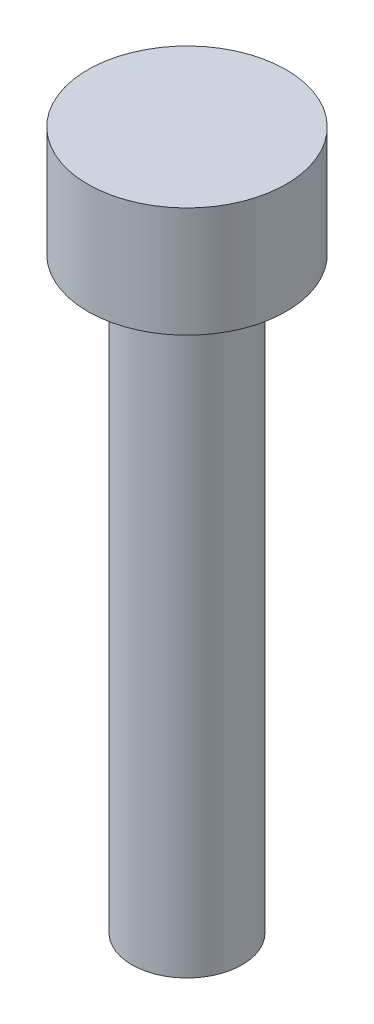
ISO-10303-21;
HEADER;
FILE_DESCRIPTION(('STEP AP214'),'2;1');
FILE_NAME('part.step','',(''),(''),'','','');
FILE_SCHEMA(('AUTOMOTIVE_DESIGN { 1 0 10303 214 1 1 1 1 }'));
ENDSEC;
DATA;
#1=APPLICATION_CONTEXT('core data for automotive mechanical design processes');
#2=APPLICATION_PROTOCOL_DEFINITION('international standard','automotive_design',2000,#1);
#3=PRODUCT_CONTEXT('',#1,'mechanical');
#4=PRODUCT('Part','Part','',(#3));
#5=PRODUCT_RELATED_PRODUCT_CATEGORY('part','',(#4));
#6=PRODUCT_DEFINITION_FORMATION('','',#4);
#7=PRODUCT_DEFINITION_CONTEXT('part definition',#1,'design');
#8=PRODUCT_DEFINITION('design','',#6,#7);
#9=PRODUCT_DEFINITION_SHAPE('','',#8);
#10=(LENGTH_UNIT() NAMED_UNIT(*) SI_UNIT(.MILLI.,.METRE.));
#11=(NAMED_UNIT(*) PLANE_ANGLE_UNIT() SI_UNIT($,.RADIAN.));
#12=(NAMED_UNIT(*) SI_UNIT($,.STERADIAN.) SOLID_ANGLE_UNIT());
#13=UNCERTAINTY_MEASURE_WITH_UNIT(LENGTH_MEASURE(1.E-05),#10,'distance_accuracy_value','');
#14=(GEOMETRIC_REPRESENTATION_CONTEXT(3) GLOBAL_UNCERTAINTY_ASSIGNED_CONTEXT((#13)) GLOBAL_UNIT_ASSIGNED_CONTEXT((#10,
#11,#12)) REPRESENTATION_CONTEXT('',''));
#15=CARTESIAN_POINT('',(0.,0.,0.));
#16=DIRECTION('',(0.,0.,1.));
#17=DIRECTION('',(1.,0.,0.));
#18=AXIS2_PLACEMENT_3D('',#15,#16,#17);
#19=CARTESIAN_POINT('',(0.,16.,0.));
#20=DIRECTION('',(0.,-1.,0.));
#21=DIRECTION('',(0.,0.,-1.));
#22=AXIS2_PLACEMENT_3D('',#19,#20,#21);
#23=CYLINDRICAL_SURFACE('',#22,1.5);
#24=CARTESIAN_POINT('',(0.,16.,0.));
#25=DIRECTION('',(0.,1.,0.));
#26=DIRECTION('',(0.,0.,1.));
#27=AXIS2_PLACEMENT_3D('',#24,#25,#26);
#28=CIRCLE('',#27,1.5);
#29=CARTESIAN_POINT('',(0.,16.,1.5));
#30=VERTEX_POINT('',#29);
#31=EDGE_CURVE('E10',#30,#30,#28,.T.);
#32=ORIENTED_EDGE('',*,*,#31,.F.);
#33=EDGE_LOOP('',(#32));
#34=FACE_BOUND('',#33,.T.);
#35=CARTESIAN_POINT('',(0.,0.,0.));
#36=DIRECTION('',(0.,1.,0.));
#37=DIRECTION('',(0.,0.,1.));
#38=AXIS2_PLACEMENT_3D('',#35,#36,#37);
#39=CIRCLE('',#38,1.5);
#40=CARTESIAN_POINT('',(0.,0.,1.5));
#41=VERTEX_POINT('',#40);
#42=EDGE_CURVE('E34',#41,#41,#39,.T.);
#43=ORIENTED_EDGE('',*,*,#42,.T.);
#44=EDGE_LOOP('',(#43));
#45=FACE_BOUND('',#44,.T.);
#46=ADVANCED_FACE('F31',(#34,#45),#23,.T.);
#47=CARTESIAN_POINT('',(0.,0.,0.));
#48=DIRECTION('',(0.,1.,0.));
#49=DIRECTION('',(0.,0.,1.));
#50=AXIS2_PLACEMENT_3D('',#47,#48,#49);
#51=PLANE('',#50);
#52=ORIENTED_EDGE('',*,*,#42,.F.);
#53=EDGE_LOOP('',(#52));
#54=FACE_BOUND('',#53,.T.);
#55=ADVANCED_FACE('F54',(#54),#51,.F.);
#56=CARTESIAN_POINT('',(0.,19.,0.));
#57=DIRECTION('',(0.,-1.,0.));
#58=DIRECTION('',(0.,0.,-1.));
#59=AXIS2_PLACEMENT_3D('',#56,#57,#58);
#60=CYLINDRICAL_SURFACE('',#59,2.7);
#61=CARTESIAN_POINT('',(0.,19.,0.));
#62=DIRECTION('',(0.,1.,0.));
#63=DIRECTION('',(0.,0.,1.));
#64=AXIS2_PLACEMENT_3D('',#61,#62,#63);
#65=CIRCLE('',#64,2.7);
#66=CARTESIAN_POINT('',(0.,19.,2.7));
#67=VERTEX_POINT('',#66);
#68=EDGE_CURVE('E41',#67,#67,#65,.T.);
#69=ORIENTED_EDGE('',*,*,#68,.F.);
#70=EDGE_LOOP('',(#69));
#71=FACE_BOUND('',#70,.T.);
#72=CARTESIAN_POINT('',(0.,16.,0.));
#73=DIRECTION('',(0.,1.,0.));
#74=DIRECTION('',(0.,0.,1.));
#75=AXIS2_PLACEMENT_3D('',#72,#73,#74);
#76=CIRCLE('',#75,2.7);
#77=CARTESIAN_POINT('',(0.,16.,2.7));
#78=VERTEX_POINT('',#77);
#79=EDGE_CURVE('E43',#78,#78,#76,.T.);
#80=ORIENTED_EDGE('',*,*,#79,.T.);
#81=EDGE_LOOP('',(#80));
#82=FACE_BOUND('',#81,.T.);
#83=ADVANCED_FACE('F51',(#71,#82),#60,.T.);
#84=CARTESIAN_POINT('',(0.,19.,0.));
#85=DIRECTION('',(0.,1.,0.));
#86=DIRECTION('',(0.,0.,1.));
#87=AXIS2_PLACEMENT_3D('',#84,#85,#86);
#88=PLANE('',#87);
#89=ORIENTED_EDGE('',*,*,#68,.T.);
#90=EDGE_LOOP('',(#89));
#91=FACE_BOUND('',#90,.T.);
#92=ADVANCED_FACE('F49',(#91),#88,.T.);
#93=CARTESIAN_POINT('',(0.,16.,0.));
#94=DIRECTION('',(0.,1.,0.));
#95=DIRECTION('',(0.,0.,1.));
#96=AXIS2_PLACEMENT_3D('',#93,#94,#95);
#97=PLANE('',#96);
#98=ORIENTED_EDGE('',*,*,#31,.T.);
#99=EDGE_LOOP('',(#98));
#100=FACE_BOUND('',#99,.T.);
#101=ORIENTED_EDGE('',*,*,#79,.F.);
#102=EDGE_LOOP('',(#101));
#103=FACE_BOUND('',#102,.T.);
#104=ADVANCED_FACE('F58',(#100,#103),#97,.F.);
#105=CLOSED_SHELL('',(#46,#55,#83,#92,#104));
#106=MANIFOLD_SOLID_BREP('B2',#105);
#107=ADVANCED_BREP_SHAPE_REPRESENTATION('',(#18,#106),#14);
#108=SHAPE_DEFINITION_REPRESENTATION(#9,#107);
ENDSEC;
END-ISO-10303-21;
